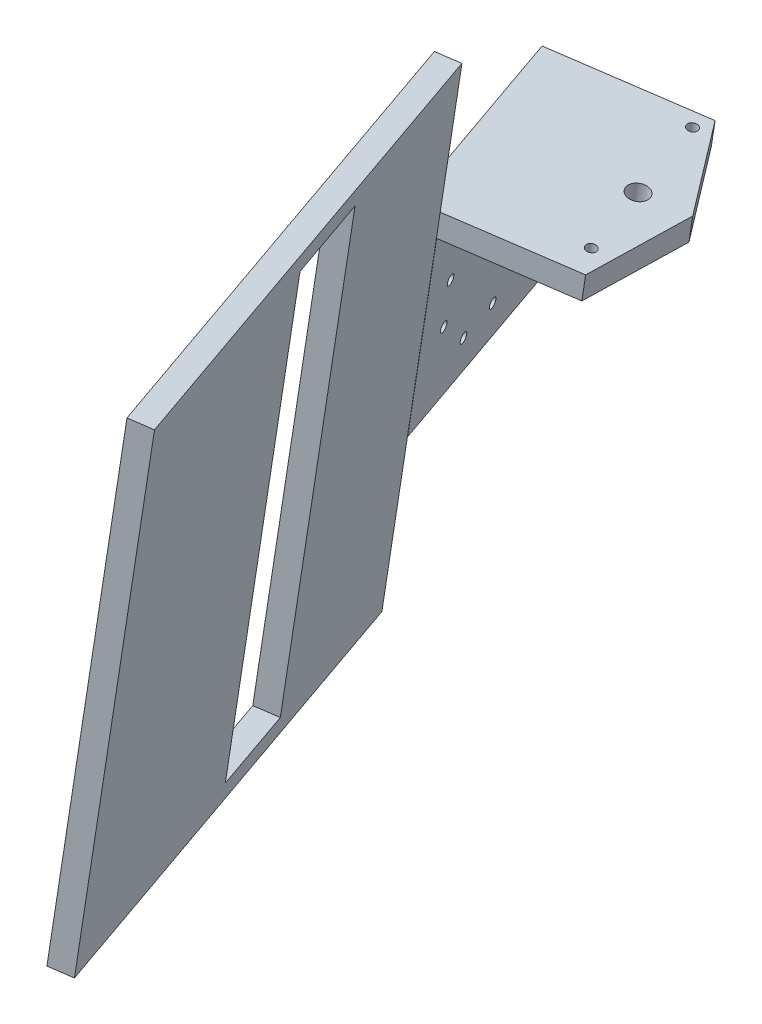
ISO-10303-21;
HEADER;
FILE_DESCRIPTION(('STEP AP214'),'2;1');
FILE_NAME('part.step','',(''),(''),'','','');
FILE_SCHEMA(('AUTOMOTIVE_DESIGN { 1 0 10303 214 1 1 1 1 }'));
ENDSEC;
DATA;
#1=APPLICATION_CONTEXT('core data for automotive mechanical design processes');
#2=APPLICATION_PROTOCOL_DEFINITION('international standard','automotive_design',2000,#1);
#3=PRODUCT_CONTEXT('',#1,'mechanical');
#4=PRODUCT('Part','Part','',(#3));
#5=PRODUCT_RELATED_PRODUCT_CATEGORY('part','',(#4));
#6=PRODUCT_DEFINITION_FORMATION('','',#4);
#7=PRODUCT_DEFINITION_CONTEXT('part definition',#1,'design');
#8=PRODUCT_DEFINITION('design','',#6,#7);
#9=PRODUCT_DEFINITION_SHAPE('','',#8);
#10=(LENGTH_UNIT() NAMED_UNIT(*) SI_UNIT(.MILLI.,.METRE.));
#11=(NAMED_UNIT(*) PLANE_ANGLE_UNIT() SI_UNIT($,.RADIAN.));
#12=(NAMED_UNIT(*) SI_UNIT($,.STERADIAN.) SOLID_ANGLE_UNIT());
#13=UNCERTAINTY_MEASURE_WITH_UNIT(LENGTH_MEASURE(1.E-05),#10,'distance_accuracy_value','');
#14=(GEOMETRIC_REPRESENTATION_CONTEXT(3) GLOBAL_UNCERTAINTY_ASSIGNED_CONTEXT((#13)) GLOBAL_UNIT_ASSIGNED_CONTEXT((#10,
#11,#12)) REPRESENTATION_CONTEXT('',''));
#15=CARTESIAN_POINT('',(0.,0.,0.));
#16=DIRECTION('',(0.,0.,1.));
#17=DIRECTION('',(1.,0.,0.));
#18=AXIS2_PLACEMENT_3D('',#15,#16,#17);
#19=CARTESIAN_POINT('',(-17.1863898613253,-49.3493626295614,61.5794038347499));
#20=DIRECTION('',(0.300437155148662,-0.046712923054129,0.95265703095391));
#21=DIRECTION('',(0.953698130209388,0.,-0.30076548411531));
#22=AXIS2_PLACEMENT_3D('',#19,#20,#21);
#23=PLANE('',#22);
#24=DIRECTION('',(0.941346447465451,-0.146363535315639,-0.304047005204922));
#25=VECTOR('',#24,1.);
#26=CARTESIAN_POINT('',(16.7261494264922,22.7969804188848,54.422137332226));
#27=LINE('',#26,#25);
#28=CARTESIAN_POINT('',(-9.63155110254046,26.8951594077227,62.9354534779639));
#29=VERTEX_POINT('',#28);
#30=CARTESIAN_POINT('',(-5.43314594684452,26.242378040215,61.5794038347499));
#31=VERTEX_POINT('',#30);
#32=EDGE_CURVE('E175',#29,#31,#27,.T.);
#33=ORIENTED_EDGE('',*,*,#32,.F.);
#34=DIRECTION('',(-0.15363717535269,-0.988127329016684,0.));
#35=VECTOR('',#34,1.);
#36=CARTESIAN_POINT('',(-21.3847950170213,-48.6965812620537,62.9354534779639));
#37=LINE('',#36,#35);
#38=CARTESIAN_POINT('',(-5.25289160498879,55.0567882846982,62.9354534779639));
#39=VERTEX_POINT('',#38);
#40=EDGE_CURVE('E189',#39,#29,#37,.T.);
#41=ORIENTED_EDGE('',*,*,#40,.F.);
#42=DIRECTION('',(-0.941346447465451,0.146363535315639,0.304047005204922));
#43=VECTOR('',#42,1.);
#44=CARTESIAN_POINT('',(-1.05448644929285,54.4040069171904,61.5794038347499));
#45=LINE('',#44,#43);
#46=CARTESIAN_POINT('',(-1.05448644929285,54.4040069171904,61.5794038347499));
#47=VERTEX_POINT('',#46);
#48=EDGE_CURVE('E265',#47,#39,#45,.T.);
#49=ORIENTED_EDGE('',*,*,#48,.F.);
#50=DIRECTION('',(0.15363717535269,0.988127329016684,0.));
#51=VECTOR('',#50,1.);
#52=CARTESIAN_POINT('',(-17.1863898613253,-49.3493626295614,61.5794038347499));
#53=LINE('',#52,#51);
#54=EDGE_CURVE('E191',#31,#47,#53,.T.);
#55=ORIENTED_EDGE('',*,*,#54,.F.);
#56=EDGE_LOOP('',(#33,#41,#49,#55));
#57=FACE_BOUND('',#56,.T.);
#58=ADVANCED_FACE('F41',(#57),#23,.F.);
#59=DIRECTION('',(-0.941346447465451,0.146363535315639,0.304047005204922));
#60=VECTOR('',#59,1.);
#61=CARTESIAN_POINT('',(-15.2966031952407,-15.7406792753104,62.6314064727589));
#62=LINE('',#61,#60);
#63=CARTESIAN_POINT('',(-12.0395444870102,-16.2470971075025,61.5794038347499));
#64=VERTEX_POINT('',#63);
#65=CARTESIAN_POINT('',(-16.2379496427062,-15.5943157399947,62.9354534779639));
#66=VERTEX_POINT('',#65);
#67=EDGE_CURVE('E260',#64,#66,#62,.T.);
#68=ORIENTED_EDGE('',*,*,#67,.F.);
#69=CARTESIAN_POINT('',(-17.1863898613253,-49.3493626295614,61.5794038347499));
#70=VERTEX_POINT('',#69);
#71=EDGE_CURVE('E249',#70,#64,#53,.T.);
#72=ORIENTED_EDGE('',*,*,#71,.F.);
#73=DIRECTION('',(-0.941346447465451,0.146363535315639,0.304047005204922));
#74=VECTOR('',#73,1.);
#75=CARTESIAN_POINT('',(-17.1863898613253,-49.3493626295614,61.5794038347499));
#76=LINE('',#75,#74);
#77=CARTESIAN_POINT('',(-21.3847950170213,-48.6965812620537,62.9354534779639));
#78=VERTEX_POINT('',#77);
#79=EDGE_CURVE('E261',#70,#78,#76,.T.);
#80=ORIENTED_EDGE('',*,*,#79,.T.);
#81=DIRECTION('',(-0.15363717535269,-0.988127329016684,0.));
#82=VECTOR('',#81,1.);
#83=CARTESIAN_POINT('',(-21.3847950170213,-48.6965812620537,62.9354534779639));
#84=LINE('',#83,#82);
#85=EDGE_CURVE('E203',#66,#78,#84,.T.);
#86=ORIENTED_EDGE('',*,*,#85,.F.);
#87=EDGE_LOOP('',(#68,#72,#80,#86));
#88=FACE_BOUND('',#87,.T.);
#89=ADVANCED_FACE('F368',(#88),#23,.F.);
#90=CARTESIAN_POINT('',(-6.35576339228975,3.10947705619133,18.748232135709));
#91=DIRECTION('',(-0.300437155148661,0.0467129230541289,-0.95265703095391));
#92=DIRECTION('',(0.15363717535269,0.988127329016684,0.));
#93=AXIS2_PLACEMENT_3D('',#90,#91,#92);
#94=PLANE('',#93);
#95=DIRECTION('',(0.941346447465451,-0.146363535315639,-0.304047005204922));
#96=VECTOR('',#95,1.);
#97=CARTESIAN_POINT('',(-2.64894778847588,20.749405443176,18.4441851305041));
#98=LINE('',#97,#96);
#99=CARTESIAN_POINT('',(-18.1811641716558,23.1644037758841,23.4609607163853));
#100=VERTEX_POINT('',#99);
#101=CARTESIAN_POINT('',(3.94047734378228,19.7248606959665,16.3158560940696));
#102=VERTEX_POINT('',#101);
#103=EDGE_CURVE('E302',#100,#102,#98,.T.);
#104=ORIENTED_EDGE('',*,*,#103,.F.);
#105=DIRECTION('',(0.15363717535269,0.988127329016684,0.));
#106=VECTOR('',#105,1.);
#107=CARTESIAN_POINT('',(-18.1811641716558,23.1644037758841,23.4609607163853));
#108=LINE('',#107,#106);
#109=CARTESIAN_POINT('',(-24.019376835058,-14.3844347267499,23.4609607163853));
#110=VERTEX_POINT('',#109);
#111=EDGE_CURVE('E423',#110,#100,#108,.T.);
#112=ORIENTED_EDGE('',*,*,#111,.F.);
#113=DIRECTION('',(0.941346447465451,-0.146363535315639,-0.304047005204922));
#114=VECTOR('',#113,1.);
#115=CARTESIAN_POINT('',(-27.3140894011871,-13.8721623531452,24.5251252346025));
#116=LINE('',#115,#114);
#117=CARTESIAN_POINT('',(-28.2554358486526,-13.7257988178296,24.8291722398075));
#118=VERTEX_POINT('',#117);
#119=EDGE_CURVE('E311',#118,#110,#116,.T.);
#120=ORIENTED_EDGE('',*,*,#119,.F.);
#121=DIRECTION('',(-0.15363717535269,-0.988127329016684,0.));
#122=VECTOR('',#121,1.);
#123=CARTESIAN_POINT('',(-25.1826923415988,6.03674776250411,24.8291722398075));
#124=LINE('',#123,#122);
#125=CARTESIAN_POINT('',(-21.6490373084869,28.7636763298879,24.8291722398075));
#126=VERTEX_POINT('',#125);
#127=EDGE_CURVE('E292',#126,#118,#124,.T.);
#128=ORIENTED_EDGE('',*,*,#127,.F.);
#129=DIRECTION('',(-0.941346447465451,0.146363535315639,0.304047005204922));
#130=VECTOR('',#129,1.);
#131=CARTESIAN_POINT('',(-21.6490373084869,28.7636763298879,24.8291722398075));
#132=LINE('',#131,#130);
#133=CARTESIAN_POINT('',(4.70866322054573,24.66549734105,16.3158560940696));
#134=VERTEX_POINT('',#133);
#135=EDGE_CURVE('E179',#134,#126,#132,.T.);
#136=ORIENTED_EDGE('',*,*,#135,.F.);
#137=DIRECTION('',(-0.15363717535269,-0.988127329016684,0.));
#138=VECTOR('',#137,1.);
#139=CARTESIAN_POINT('',(1.17500818743386,1.93856877366622,16.3158560940696));
#140=LINE('',#139,#138);
#141=EDGE_CURVE('E305',#134,#102,#140,.T.);
#142=ORIENTED_EDGE('',*,*,#141,.T.);
#143=EDGE_LOOP('',(#104,#112,#120,#128,#136,#142));
#144=FACE_BOUND('',#143,.T.);
#145=ADVANCED_FACE('F373',(#144),#94,.T.);
#146=CARTESIAN_POINT('',(-27.3140894011871,-13.8721623531452,24.5251252346025));
#147=DIRECTION('',(-0.15363717535269,-0.988127329016684,0.));
#148=DIRECTION('',(-0.300437155148661,0.0467129230541289,-0.95265703095391));
#149=AXIS2_PLACEMENT_3D('',#146,#147,#148);
#150=PLANE('',#149);
#151=ORIENTED_EDGE('',*,*,#67,.T.);
#152=DIRECTION('',(0.300437155148661,-0.0467129230541289,0.95265703095391));
#153=VECTOR('',#152,1.);
#154=CARTESIAN_POINT('',(-28.2554358486526,-13.7257988178296,24.8291722398075));
#155=LINE('',#154,#153);
#156=EDGE_CURVE('E315',#118,#66,#155,.T.);
#157=ORIENTED_EDGE('',*,*,#156,.F.);
#158=ORIENTED_EDGE('',*,*,#119,.T.);
#159=DIRECTION('',(-0.300437155148662,0.0467129230541289,-0.952657030953909));
#160=VECTOR('',#159,1.);
#161=CARTESIAN_POINT('',(-12.0018906291116,-16.2529516489151,61.5672419545417));
#162=LINE('',#161,#160);
#163=CARTESIAN_POINT('',(-12.0018906291116,-16.2529516489151,61.5672419545417));
#164=VERTEX_POINT('',#163);
#165=EDGE_CURVE('E413',#164,#110,#162,.T.);
#166=ORIENTED_EDGE('',*,*,#165,.F.);
#167=DIRECTION('',(-0.941346447465451,0.146363535315639,0.304047005204922));
#168=VECTOR('',#167,1.);
#169=CARTESIAN_POINT('',(-12.0018906291116,-16.2529516489151,61.5672419545417));
#170=LINE('',#169,#168);
#171=EDGE_CURVE('E429',#164,#64,#170,.T.);
#172=ORIENTED_EDGE('',*,*,#171,.T.);
#173=EDGE_LOOP('',(#151,#157,#158,#166,#172));
#174=FACE_BOUND('',#173,.T.);
#175=ADVANCED_FACE('F386',(#174),#150,.T.);
#176=CARTESIAN_POINT('',(11.3551398777975,-53.7870903197037,152.081821775371));
#177=DIRECTION('',(0.300437155148662,-0.046712923054129,0.95265703095391));
#178=DIRECTION('',(0.953698130209388,0.,-0.30076548411531));
#179=AXIS2_PLACEMENT_3D('',#176,#177,#178);
#180=PLANE('',#179);
#181=DIRECTION('',(-0.941346447465451,0.146363535315639,0.304047005204922));
#182=VECTOR('',#181,1.);
#183=CARTESIAN_POINT('',(27.48704328983,49.9662792270482,152.081821775371));
#184=LINE('',#183,#182);
#185=CARTESIAN_POINT('',(27.48704328983,49.9662792270482,152.081821775371));
#186=VERTEX_POINT('',#185);
#187=CARTESIAN_POINT('',(23.288638134134,50.6190605945559,153.437871418585));
#188=VERTEX_POINT('',#187);
#189=EDGE_CURVE('E255',#186,#188,#184,.T.);
#190=ORIENTED_EDGE('',*,*,#189,.T.);
#191=DIRECTION('',(-0.15363717535269,-0.988127329016684,0.));
#192=VECTOR('',#191,1.);
#193=CARTESIAN_POINT('',(7.15673472210156,-53.1343089521959,153.437871418585));
#194=LINE('',#193,#192);
#195=CARTESIAN_POINT('',(7.15673472210156,-53.1343089521959,153.437871418585));
#196=VERTEX_POINT('',#195);
#197=EDGE_CURVE('E65',#188,#196,#194,.T.);
#198=ORIENTED_EDGE('',*,*,#197,.T.);
#199=DIRECTION('',(-0.941346447465451,0.146363535315639,0.304047005204922));
#200=VECTOR('',#199,1.);
#201=CARTESIAN_POINT('',(11.3551398777975,-53.7870903197037,152.081821775371));
#202=LINE('',#201,#200);
#203=CARTESIAN_POINT('',(11.3551398777975,-53.7870903197037,152.081821775371));
#204=VERTEX_POINT('',#203);
#205=EDGE_CURVE('E256',#204,#196,#202,.T.);
#206=ORIENTED_EDGE('',*,*,#205,.F.);
#207=DIRECTION('',(0.15363717535269,0.988127329016684,0.));
#208=VECTOR('',#207,1.);
#209=CARTESIAN_POINT('',(11.3551398777975,-53.7870903197037,152.081821775371));
#210=LINE('',#209,#208);
#211=EDGE_CURVE('E241',#204,#186,#210,.T.);
#212=ORIENTED_EDGE('',*,*,#211,.T.);
#213=EDGE_LOOP('',(#190,#198,#206,#212));
#214=FACE_BOUND('',#213,.T.);
#215=ADVANCED_FACE('F383',(#214),#180,.T.);
#216=CARTESIAN_POINT('',(11.3551398777975,-53.7870903197037,152.081821775371));
#217=DIRECTION('',(0.15363717535269,0.988127329016684,0.));
#218=DIRECTION('',(-0.988127329016684,0.15363717535269,0.));
#219=AXIS2_PLACEMENT_3D('',#216,#217,#218);
#220=PLANE('',#219);
#221=DIRECTION('',(0.300437155148661,-0.0467129230541289,0.95265703095391));
#222=VECTOR('',#221,1.);
#223=CARTESIAN_POINT('',(7.15673472210156,-53.1343089521959,153.437871418585));
#224=LINE('',#223,#222);
#225=EDGE_CURVE('E199',#78,#196,#224,.T.);
#226=ORIENTED_EDGE('',*,*,#225,.F.);
#227=ORIENTED_EDGE('',*,*,#79,.F.);
#228=DIRECTION('',(-0.300437155148662,0.046712923054129,-0.952657030953909));
#229=VECTOR('',#228,1.);
#230=CARTESIAN_POINT('',(11.3551398777975,-53.7870903197037,152.081821775371));
#231=LINE('',#230,#229);
#232=EDGE_CURVE('E252',#204,#70,#231,.T.);
#233=ORIENTED_EDGE('',*,*,#232,.F.);
#234=ORIENTED_EDGE('',*,*,#205,.T.);
#235=EDGE_LOOP('',(#226,#227,#233,#234));
#236=FACE_BOUND('',#235,.T.);
#237=ADVANCED_FACE('F377',(#236),#220,.F.);
#238=CARTESIAN_POINT('',(27.48704328983,49.9662792270482,152.081821775371));
#239=DIRECTION('',(0.15363717535269,0.988127329016684,0.));
#240=DIRECTION('',(-0.988127329016684,0.15363717535269,0.));
#241=AXIS2_PLACEMENT_3D('',#238,#239,#240);
#242=PLANE('',#241);
#243=ORIENTED_EDGE('',*,*,#48,.T.);
#244=DIRECTION('',(0.300437155148661,-0.0467129230541289,0.95265703095391));
#245=VECTOR('',#244,1.);
#246=CARTESIAN_POINT('',(23.288638134134,50.6190605945559,153.437871418585));
#247=LINE('',#246,#245);
#248=EDGE_CURVE('E197',#39,#188,#247,.T.);
#249=ORIENTED_EDGE('',*,*,#248,.T.);
#250=ORIENTED_EDGE('',*,*,#189,.F.);
#251=DIRECTION('',(-0.300437155148662,0.046712923054129,-0.952657030953909));
#252=VECTOR('',#251,1.);
#253=CARTESIAN_POINT('',(27.48704328983,49.9662792270482,152.081821775371));
#254=LINE('',#253,#252);
#255=EDGE_CURVE('E245',#186,#47,#254,.T.);
#256=ORIENTED_EDGE('',*,*,#255,.T.);
#257=EDGE_LOOP('',(#243,#249,#250,#256));
#258=FACE_BOUND('',#257,.T.);
#259=ADVANCED_FACE('F378',(#258),#242,.T.);
#260=CARTESIAN_POINT('',(29.5364840447831,-4.59242634550558,100.690553554661));
#261=DIRECTION('',(0.300437155148662,-0.046712923054129,0.95265703095391));
#262=DIRECTION('',(0.953698130209388,0.,-0.30076548411531));
#263=AXIS2_PLACEMENT_3D('',#260,#261,#262);
#264=PLANE('',#263);
#265=DIRECTION('',(-0.15363717535269,-0.988127329016684,0.));
#266=VECTOR('',#265,1.);
#267=CARTESIAN_POINT('',(1.2960906208195,-0.201520286036394,109.811963710808));
#268=LINE('',#267,#266);
#269=CARTESIAN_POINT('',(8.99271049848715,49.299783188971,109.811963710808));
#270=VERTEX_POINT('',#269);
#271=CARTESIAN_POINT('',(-6.06373268607651,-47.5366950546641,109.811963710808));
#272=VERTEX_POINT('',#271);
#273=EDGE_CURVE('E441',#270,#272,#268,.T.);
#274=ORIENTED_EDGE('',*,*,#273,.F.);
#275=DIRECTION('',(-0.941346447465451,0.146363535315639,0.304047005204922));
#276=VECTOR('',#275,1.);
#277=CARTESIAN_POINT('',(37.2331039224507,44.9088771295018,100.690553554661));
#278=LINE('',#277,#276);
#279=CARTESIAN_POINT('',(13.1911156541831,48.6470018214632,108.455914067594));
#280=VERTEX_POINT('',#279);
#281=EDGE_CURVE('E210',#280,#270,#278,.T.);
#282=ORIENTED_EDGE('',*,*,#281,.F.);
#283=DIRECTION('',(0.15363717535269,0.988127329016684,0.));
#284=VECTOR('',#283,1.);
#285=CARTESIAN_POINT('',(5.49449577651546,-0.854301653544155,108.455914067594));
#286=LINE('',#285,#284);
#287=CARTESIAN_POINT('',(-1.86532753038054,-48.1894764221718,108.455914067594));
#288=VERTEX_POINT('',#287);
#289=EDGE_CURVE('E237',#288,#280,#286,.T.);
#290=ORIENTED_EDGE('',*,*,#289,.F.);
#291=DIRECTION('',(-0.941346447465451,0.146363535315639,0.304047005204922));
#292=VECTOR('',#291,1.);
#293=CARTESIAN_POINT('',(22.1766607378871,-51.9276011141332,100.690553554661));
#294=LINE('',#293,#292);
#295=EDGE_CURVE('E222',#288,#272,#294,.T.);
#296=ORIENTED_EDGE('',*,*,#295,.T.);
#297=EDGE_LOOP('',(#274,#282,#290,#296));
#298=FACE_BOUND('',#297,.T.);
#299=ADVANCED_FACE('F381',(#298),#264,.F.);
#300=CARTESIAN_POINT('',(-9.37282978303244,-47.0221861285219,0.650184203887233));
#301=DIRECTION('',(0.15363717535269,0.988127329016684,0.));
#302=DIRECTION('',(-0.988127329016684,0.15363717535269,0.));
#303=AXIS2_PLACEMENT_3D('',#300,#301,#302);
#304=PLANE('',#303);
#305=DIRECTION('',(-0.941346447465451,0.146363535315639,0.304047005204922));
#306=VECTOR('',#305,1.);
#307=CARTESIAN_POINT('',(17.0692291003598,-51.1334814222131,84.4953840284441));
#308=LINE('',#307,#306);
#309=CARTESIAN_POINT('',(-6.97275916790779,-47.3953567302516,92.2607445413778));
#310=VERTEX_POINT('',#309);
#311=CARTESIAN_POINT('',(-11.1711643236038,-46.7425753627439,93.6167941845918));
#312=VERTEX_POINT('',#311);
#313=EDGE_CURVE('E218',#310,#312,#308,.T.);
#314=ORIENTED_EDGE('',*,*,#313,.T.);
#315=DIRECTION('',(0.300437155148661,-0.0467129230541288,0.95265703095391));
#316=VECTOR('',#315,1.);
#317=CARTESIAN_POINT('',(-37.613223206996,-42.6312800690527,9.7715943600349));
#318=LINE('',#317,#316);
#319=EDGE_CURVE('E437',#312,#272,#318,.T.);
#320=ORIENTED_EDGE('',*,*,#319,.T.);
#321=ORIENTED_EDGE('',*,*,#295,.F.);
#322=DIRECTION('',(-0.300437155148662,0.0467129230541289,-0.95265703095391));
#323=VECTOR('',#322,1.);
#324=CARTESIAN_POINT('',(-33.4148180513001,-43.2840614365605,8.41554471682096));
#325=LINE('',#324,#323);
#326=EDGE_CURVE('E234',#288,#310,#325,.T.);
#327=ORIENTED_EDGE('',*,*,#326,.T.);
#328=EDGE_LOOP('',(#314,#320,#321,#327));
#329=FACE_BOUND('',#328,.T.);
#330=ADVANCED_FACE('F742',(#329),#304,.T.);
#331=CARTESIAN_POINT('',(24.4290524072558,-3.79830665358538,84.4953840284441));
#332=DIRECTION('',(0.300437155148662,-0.046712923054129,0.95265703095391));
#333=DIRECTION('',(0.953698130209388,0.,-0.30076548411531));
#334=AXIS2_PLACEMENT_3D('',#331,#332,#333);
#335=PLANE('',#334);
#336=DIRECTION('',(-0.941346447465451,0.146363535315639,0.304047005204922));
#337=VECTOR('',#336,1.);
#338=CARTESIAN_POINT('',(32.1256722849235,45.702996821422,84.4953840284441));
#339=LINE('',#338,#337);
#340=CARTESIAN_POINT('',(8.08368401665586,49.4411215133834,92.2607445413778));
#341=VERTEX_POINT('',#340);
#342=CARTESIAN_POINT('',(3.88527886095991,50.0939028808912,93.6167941845918));
#343=VERTEX_POINT('',#342);
#344=EDGE_CURVE('E214',#341,#343,#339,.T.);
#345=ORIENTED_EDGE('',*,*,#344,.T.);
#346=DIRECTION('',(-0.15363717535269,-0.988127329016684,0.));
#347=VECTOR('',#346,1.);
#348=CARTESIAN_POINT('',(-3.81134101670775,0.592599405883799,93.6167941845918));
#349=LINE('',#348,#347);
#350=EDGE_CURVE('E433',#343,#312,#349,.T.);
#351=ORIENTED_EDGE('',*,*,#350,.T.);
#352=ORIENTED_EDGE('',*,*,#313,.F.);
#353=DIRECTION('',(0.15363717535269,0.988127329016684,0.));
#354=VECTOR('',#353,1.);
#355=CARTESIAN_POINT('',(0.387064138988209,-0.0601819616239622,92.2607445413778));
#356=LINE('',#355,#354);
#357=EDGE_CURVE('E230',#310,#341,#356,.T.);
#358=ORIENTED_EDGE('',*,*,#357,.T.);
#359=EDGE_LOOP('',(#345,#351,#352,#358));
#360=FACE_BOUND('',#359,.T.);
#361=ADVANCED_FACE('F738',(#360),#335,.T.);
#362=CARTESIAN_POINT('',(5.6836134015312,49.8142921151131,0.650184203887226));
#363=DIRECTION('',(0.15363717535269,0.988127329016684,0.));
#364=DIRECTION('',(-0.988127329016684,0.15363717535269,0.));
#365=AXIS2_PLACEMENT_3D('',#362,#363,#364);
#366=PLANE('',#365);
#367=DIRECTION('',(0.300437155148661,-0.0467129230541288,0.95265703095391));
#368=VECTOR('',#367,1.);
#369=CARTESIAN_POINT('',(-22.5567800224324,54.2051981745823,9.77159436003489));
#370=LINE('',#369,#368);
#371=EDGE_CURVE('E11',#343,#270,#370,.T.);
#372=ORIENTED_EDGE('',*,*,#371,.F.);
#373=ORIENTED_EDGE('',*,*,#344,.F.);
#374=DIRECTION('',(-0.300437155148662,0.0467129230541289,-0.95265703095391));
#375=VECTOR('',#374,1.);
#376=CARTESIAN_POINT('',(-18.3583748667364,53.5524168070745,8.41554471682094));
#377=LINE('',#376,#375);
#378=EDGE_CURVE('E226',#280,#341,#377,.T.);
#379=ORIENTED_EDGE('',*,*,#378,.F.);
#380=ORIENTED_EDGE('',*,*,#281,.T.);
#381=EDGE_LOOP('',(#372,#373,#379,#380));
#382=FACE_BOUND('',#381,.T.);
#383=ADVANCED_FACE('F556',(#382),#366,.F.);
#384=CARTESIAN_POINT('',(5.66172281365671,1.24096013402617,56.8545133738654));
#385=DIRECTION('',(-0.300437155148661,0.0467129230541289,-0.95265703095391));
#386=DIRECTION('',(0.15363717535269,0.988127329016684,0.));
#387=AXIS2_PLACEMENT_3D('',#384,#385,#386);
#388=PLANE('',#387);
#389=EDGE_CURVE('E57',#64,#31,#53,.T.);
#390=ORIENTED_EDGE('',*,*,#389,.F.);
#391=ORIENTED_EDGE('',*,*,#171,.F.);
#392=DIRECTION('',(-0.15363717535269,-0.988127329016684,0.));
#393=VECTOR('',#392,1.);
#394=CARTESIAN_POINT('',(-6.16367796570935,21.2958868537189,61.5672419545417));
#395=LINE('',#394,#393);
#396=CARTESIAN_POINT('',(-6.16367796570935,21.2958868537189,61.5672419545417));
#397=VERTEX_POINT('',#396);
#398=EDGE_CURVE('E407',#397,#164,#395,.T.);
#399=ORIENTED_EDGE('',*,*,#398,.F.);
#400=DIRECTION('',(0.941346447465451,-0.146363535315639,-0.304047005204922));
#401=VECTOR('',#400,1.);
#402=CARTESIAN_POINT('',(9.36853841747058,18.8808885210109,56.5504663686605));
#403=LINE('',#402,#401);
#404=CARTESIAN_POINT('',(15.9579635497287,17.8563437738014,54.422137332226));
#405=VERTEX_POINT('',#404);
#406=EDGE_CURVE('E287',#397,#405,#403,.T.);
#407=ORIENTED_EDGE('',*,*,#406,.T.);
#408=DIRECTION('',(0.15363717535269,0.988127329016684,0.));
#409=VECTOR('',#408,1.);
#410=CARTESIAN_POINT('',(16.2652379004341,19.8325984318348,54.422137332226));
#411=LINE('',#410,#409);
#412=CARTESIAN_POINT('',(16.7261494264922,22.7969804188848,54.422137332226));
#413=VERTEX_POINT('',#412);
#414=EDGE_CURVE('E329',#405,#413,#411,.T.);
#415=ORIENTED_EDGE('',*,*,#414,.T.);
#416=EDGE_CURVE('E182',#31,#413,#27,.T.);
#417=ORIENTED_EDGE('',*,*,#416,.F.);
#418=EDGE_LOOP('',(#390,#391,#399,#407,#415,#417));
#419=FACE_BOUND('',#418,.T.);
#420=ADVANCED_FACE('F551',(#419),#388,.F.);
#421=CARTESIAN_POINT('',(13.1924943933803,0.0700518515010656,54.422137332226));
#422=DIRECTION('',(0.987901933056074,-0.15360213007289,0.0213578159263423));
#423=DIRECTION('',(-0.15363717535269,-0.988127329016684,0.));
#424=AXIS2_PLACEMENT_3D('',#421,#422,#423);
#425=PLANE('',#424);
#426=DIRECTION('',(-0.0211042416049268,0.00328135451062598,0.999771895833673));
#427=VECTOR('',#426,1.);
#428=CARTESIAN_POINT('',(16.7085900889742,17.7396339755316,18.8626828750067));
#429=LINE('',#428,#427);
#430=CARTESIAN_POINT('',(16.4041675150901,17.7869665641481,33.2841029631712));
#431=VERTEX_POINT('',#430);
#432=EDGE_CURVE('E283',#431,#405,#429,.T.);
#433=ORIENTED_EDGE('',*,*,#432,.F.);
#434=DIRECTION('',(0.15363717535269,0.988127329016684,0.));
#435=VECTOR('',#434,1.);
#436=CARTESIAN_POINT('',(13.6386983587417,0.000674641847824009,33.2841029631712));
#437=LINE('',#436,#435);
#438=CARTESIAN_POINT('',(17.1723533918535,22.7276032092316,33.2841029631712));
#439=VERTEX_POINT('',#438);
#440=EDGE_CURVE('E50',#431,#439,#437,.T.);
#441=ORIENTED_EDGE('',*,*,#440,.T.);
#442=DIRECTION('',(0.0211042416049283,-0.00328135451062629,-0.999771895833673));
#443=VECTOR('',#442,1.);
#444=CARTESIAN_POINT('',(17.1723533918535,22.7276032092316,33.2841029631712));
#445=LINE('',#444,#443);
#446=EDGE_CURVE('E193',#413,#439,#445,.T.);
#447=ORIENTED_EDGE('',*,*,#446,.F.);
#448=ORIENTED_EDGE('',*,*,#414,.F.);
#449=EDGE_LOOP('',(#433,#441,#447,#448));
#450=FACE_BOUND('',#449,.T.);
#451=ADVANCED_FACE('F391',(#450),#425,.T.);
#452=CARTESIAN_POINT('',(25.9055723189235,17.321673294301,46.0102881149974));
#453=DIRECTION('',(-0.79302377836505,0.123301855659401,0.596581879827546));
#454=DIRECTION('',(0.589498859453746,-0.0916571548833023,0.802552216781831));
#455=AXIS2_PLACEMENT_3D('',#452,#453,#454);
#456=PLANE('',#455);
#457=ORIENTED_EDGE('',*,*,#440,.F.);
#458=DIRECTION('',(0.589498859453746,-0.0916571548833023,0.802552216781831));
#459=VECTOR('',#458,1.);
#460=CARTESIAN_POINT('',(2.60215560880621,19.9329472097557,14.4938456559703));
#461=LINE('',#460,#459);
#462=EDGE_CURVE('E278',#102,#431,#461,.T.);
#463=ORIENTED_EDGE('',*,*,#462,.F.);
#464=ORIENTED_EDGE('',*,*,#141,.F.);
#465=DIRECTION('',(-0.589498859453747,0.0916571548833024,-0.80255221678183));
#466=VECTOR('',#465,1.);
#467=CARTESIAN_POINT('',(4.70866322054573,24.66549734105,16.3158560940696));
#468=LINE('',#467,#466);
#469=EDGE_CURVE('E824',#439,#134,#468,.T.);
#470=ORIENTED_EDGE('',*,*,#469,.F.);
#471=EDGE_LOOP('',(#457,#463,#464,#470));
#472=FACE_BOUND('',#471,.T.);
#473=ADVANCED_FACE('F388',(#472),#456,.F.);
#474=CARTESIAN_POINT('',(8.87418941061089,-4.31860100000067,49.7429848208417));
#475=DIRECTION('',(0.15363717535269,0.988127329016684,0.));
#476=DIRECTION('',(0.941346447465451,-0.146363535315639,-0.304047005204922));
#477=AXIS2_PLACEMENT_3D('',#474,#475,#476);
#478=CYLINDRICAL_SURFACE('',#477,1.);
#479=CARTESIAN_POINT('',(12.4078444437228,18.4083275673831,49.7429848208417));
#480=DIRECTION('',(-0.15363717535269,-0.988127329016684,0.));
#481=DIRECTION('',(-0.300437155148661,0.0467129230541289,-0.95265703095391));
#482=AXIS2_PLACEMENT_3D('',#479,#480,#481);
#483=CIRCLE('',#482,1.);
#484=CARTESIAN_POINT('',(12.1074072885741,18.4550404904372,48.7903277898878));
#485=VERTEX_POINT('',#484);
#486=EDGE_CURVE('E288',#485,#485,#483,.T.);
#487=ORIENTED_EDGE('',*,*,#486,.T.);
#488=EDGE_LOOP('',(#487));
#489=FACE_BOUND('',#488,.T.);
#490=CARTESIAN_POINT('',(13.1760303204862,23.3489642124665,49.7429848208417));
#491=DIRECTION('',(0.15363717535269,0.988127329016684,0.));
#492=DIRECTION('',(-0.988127329016684,0.15363717535269,0.));
#493=AXIS2_PLACEMENT_3D('',#490,#491,#492);
#494=CIRCLE('',#493,1.);
#495=CARTESIAN_POINT('',(12.1879029914695,23.5026013878192,49.7429848208417));
#496=VERTEX_POINT('',#495);
#497=EDGE_CURVE('E876',#496,#496,#494,.T.);
#498=ORIENTED_EDGE('',*,*,#497,.T.);
#499=EDGE_LOOP('',(#498));
#500=FACE_BOUND('',#499,.T.);
#501=ADVANCED_FACE('F390',(#489,#500),#478,.F.);
#502=CARTESIAN_POINT('',(-0.529493545542209,-2.85648650840643,19.9248197519843));
#503=DIRECTION('',(0.15363717535269,0.988127329016684,0.));
#504=DIRECTION('',(0.941346447465451,-0.146363535315639,-0.304047005204922));
#505=AXIS2_PLACEMENT_3D('',#502,#503,#504);
#506=CYLINDRICAL_SURFACE('',#505,1.);
#507=CARTESIAN_POINT('',(3.00416148756966,19.8704420589773,19.9248197519843));
#508=DIRECTION('',(-0.15363717535269,-0.988127329016684,0.));
#509=DIRECTION('',(-0.300437155148661,0.0467129230541289,-0.95265703095391));
#510=AXIS2_PLACEMENT_3D('',#507,#508,#509);
#511=CIRCLE('',#510,1.);
#512=CARTESIAN_POINT('',(2.703724332421,19.9171549820314,18.9721627210304));
#513=VERTEX_POINT('',#512);
#514=EDGE_CURVE('E279',#513,#513,#511,.T.);
#515=ORIENTED_EDGE('',*,*,#514,.T.);
#516=EDGE_LOOP('',(#515));
#517=FACE_BOUND('',#516,.T.);
#518=CARTESIAN_POINT('',(3.77234736433311,24.8110787040607,19.9248197519843));
#519=DIRECTION('',(0.15363717535269,0.988127329016684,0.));
#520=DIRECTION('',(-0.988127329016684,0.15363717535269,0.));
#521=AXIS2_PLACEMENT_3D('',#518,#519,#520);
#522=CIRCLE('',#521,1.);
#523=CARTESIAN_POINT('',(2.78422003531643,24.9647158794134,19.9248197519843));
#524=VERTEX_POINT('',#523);
#525=EDGE_CURVE('E183',#524,#524,#522,.T.);
#526=ORIENTED_EDGE('',*,*,#525,.T.);
#527=EDGE_LOOP('',(#526));
#528=FACE_BOUND('',#527,.T.);
#529=ADVANCED_FACE('F698',(#517,#528),#506,.F.);
#530=CARTESIAN_POINT('',(4.53287251871274,-3.6435992618685,35.9770907235577));
#531=DIRECTION('',(0.15363717535269,0.988127329016684,0.));
#532=DIRECTION('',(0.941346447465451,-0.146363535315639,-0.304047005204922));
#533=AXIS2_PLACEMENT_3D('',#530,#531,#532);
#534=CYLINDRICAL_SURFACE('',#533,2.);
#535=CARTESIAN_POINT('',(8.06652755182461,19.0833293055152,35.9770907235577));
#536=DIRECTION('',(-0.15363717535269,-0.988127329016684,0.));
#537=DIRECTION('',(-0.300437155148661,0.0467129230541289,-0.95265703095391));
#538=AXIS2_PLACEMENT_3D('',#535,#536,#537);
#539=CIRCLE('',#538,2.);
#540=CARTESIAN_POINT('',(7.46565324152728,19.1767551516235,34.0717766616499));
#541=VERTEX_POINT('',#540);
#542=EDGE_CURVE('E275',#541,#541,#539,.T.);
#543=ORIENTED_EDGE('',*,*,#542,.T.);
#544=EDGE_LOOP('',(#543));
#545=FACE_BOUND('',#544,.T.);
#546=CARTESIAN_POINT('',(8.83471342858806,24.0239659505987,35.9770907235577));
#547=DIRECTION('',(0.15363717535269,0.988127329016684,0.));
#548=DIRECTION('',(-0.988127329016684,0.15363717535269,0.));
#549=AXIS2_PLACEMENT_3D('',#546,#547,#548);
#550=CIRCLE('',#549,2.);
#551=CARTESIAN_POINT('',(6.85845877055469,24.3312403013041,35.9770907235577));
#552=VERTEX_POINT('',#551);
#553=EDGE_CURVE('E872',#552,#552,#550,.T.);
#554=ORIENTED_EDGE('',*,*,#553,.T.);
#555=EDGE_LOOP('',(#554));
#556=FACE_BOUND('',#555,.T.);
#557=ADVANCED_FACE('F581',(#545,#556),#534,.F.);
#558=CARTESIAN_POINT('',(1.29561479773957,6.47388543728225,24.3729248418387));
#559=DIRECTION('',(-0.941346447465451,0.146363535315639,0.304047005204922));
#560=DIRECTION('',(0.15363717535269,0.988127329016684,0.));
#561=AXIS2_PLACEMENT_3D('',#558,#559,#560);
#562=CYLINDRICAL_SURFACE('',#561,1.);
#563=CARTESIAN_POINT('',(-22.2380463888967,10.1329738201732,31.9740999719618));
#564=DIRECTION('',(-0.941346447465451,0.146363535315639,0.304047005204922));
#565=DIRECTION('',(0.15363717535269,0.988127329016684,0.));
#566=AXIS2_PLACEMENT_3D('',#563,#564,#565);
#567=CIRCLE('',#566,1.);
#568=CARTESIAN_POINT('',(-22.084409213544,11.1211011491899,31.9740999719618));
#569=VERTEX_POINT('',#568);
#570=EDGE_CURVE('E274',#569,#569,#567,.T.);
#571=ORIENTED_EDGE('',*,*,#570,.T.);
#572=EDGE_LOOP('',(#571));
#573=FACE_BOUND('',#572,.T.);
#574=CARTESIAN_POINT('',(-18.0019873753022,9.47433791125285,30.6058884485396));
#575=DIRECTION('',(0.941346447465451,-0.146363535315639,-0.304047005204922));
#576=DIRECTION('',(-0.307356972182089,0.,-0.951594289417007));
#577=AXIS2_PLACEMENT_3D('',#574,#575,#576);
#578=CIRCLE('',#577,1.);
#579=CARTESIAN_POINT('',(-18.3093443474843,9.47433791125285,29.6542941591226));
#580=VERTEX_POINT('',#579);
#581=EDGE_CURVE('E829',#580,#580,#578,.T.);
#582=ORIENTED_EDGE('',*,*,#581,.T.);
#583=EDGE_LOOP('',(#582));
#584=FACE_BOUND('',#583,.T.);
#585=ADVANCED_FACE('F43',(#573,#584),#562,.F.);
#586=CARTESIAN_POINT('',(-0.0871197804346371,-2.41926052386791,24.3729248418387));
#587=DIRECTION('',(-0.941346447465451,0.146363535315639,0.304047005204922));
#588=DIRECTION('',(0.15363717535269,0.988127329016684,0.));
#589=AXIS2_PLACEMENT_3D('',#586,#587,#588);
#590=CYLINDRICAL_SURFACE('',#589,1.);
#591=CARTESIAN_POINT('',(-23.6207809670709,1.23982785902307,31.9740999719618));
#592=DIRECTION('',(-0.941346447465451,0.146363535315639,0.304047005204922));
#593=DIRECTION('',(0.15363717535269,0.988127329016684,0.));
#594=AXIS2_PLACEMENT_3D('',#591,#592,#593);
#595=CIRCLE('',#594,1.);
#596=CARTESIAN_POINT('',(-23.4671437917182,2.22795518803975,31.9740999719618));
#597=VERTEX_POINT('',#596);
#598=EDGE_CURVE('E296',#597,#597,#595,.T.);
#599=ORIENTED_EDGE('',*,*,#598,.T.);
#600=EDGE_LOOP('',(#599));
#601=FACE_BOUND('',#600,.T.);
#602=CARTESIAN_POINT('',(-19.3847219534764,0.581191950102692,30.6058884485396));
#603=DIRECTION('',(0.941346447465451,-0.146363535315639,-0.304047005204922));
#604=DIRECTION('',(-0.307356972182089,0.,-0.951594289417007));
#605=AXIS2_PLACEMENT_3D('',#602,#603,#604);
#606=CIRCLE('',#605,1.);
#607=CARTESIAN_POINT('',(-19.6920789256585,0.581191950102692,29.6542941591226));
#608=VERTEX_POINT('',#607);
#609=EDGE_CURVE('E833',#608,#608,#606,.T.);
#610=ORIENTED_EDGE('',*,*,#609,.T.);
#611=EDGE_LOOP('',(#610));
#612=FACE_BOUND('',#611,.T.);
#613=ADVANCED_FACE('F580',(#601,#612),#590,.F.);
#614=CARTESIAN_POINT('',(7.63214383808834,13.5847843774955,40.5680943680552));
#615=DIRECTION('',(-0.941346447465451,0.146363535315639,0.304047005204922));
#616=DIRECTION('',(0.15363717535269,0.988127329016684,0.));
#617=AXIS2_PLACEMENT_3D('',#614,#615,#616);
#618=CYLINDRICAL_SURFACE('',#617,1.);
#619=CARTESIAN_POINT('',(-15.901517348548,17.2438727603865,48.1692694981782));
#620=DIRECTION('',(-0.941346447465451,0.146363535315639,0.304047005204922));
#621=DIRECTION('',(0.15363717535269,0.988127329016684,0.));
#622=AXIS2_PLACEMENT_3D('',#619,#620,#621);
#623=CIRCLE('',#622,1.);
#624=CARTESIAN_POINT('',(-15.7478801731953,18.2320000894032,48.1692694981782));
#625=VERTEX_POINT('',#624);
#626=EDGE_CURVE('E295',#625,#625,#623,.T.);
#627=ORIENTED_EDGE('',*,*,#626,.T.);
#628=EDGE_LOOP('',(#627));
#629=FACE_BOUND('',#628,.T.);
#630=CARTESIAN_POINT('',(-11.6654583349534,16.5852368514661,46.8010579747561));
#631=DIRECTION('',(0.941346447465451,-0.146363535315639,-0.304047005204922));
#632=DIRECTION('',(-0.307356972182089,0.,-0.951594289417007));
#633=AXIS2_PLACEMENT_3D('',#630,#631,#632);
#634=CIRCLE('',#633,0.999999999999997);
#635=CARTESIAN_POINT('',(-11.9728153071355,16.5852368514661,45.8494636853391));
#636=VERTEX_POINT('',#635);
#637=EDGE_CURVE('E837',#636,#636,#634,.T.);
#638=ORIENTED_EDGE('',*,*,#637,.T.);
#639=EDGE_LOOP('',(#638));
#640=FACE_BOUND('',#639,.T.);
#641=ADVANCED_FACE('F593',(#629,#640),#618,.F.);
#642=CARTESIAN_POINT('',(7.4238090982819,-3.58708360022113,48.1893506156865));
#643=DIRECTION('',(-0.941346447465451,0.146363535315639,0.304047005204922));
#644=DIRECTION('',(0.15363717535269,0.988127329016684,0.));
#645=AXIS2_PLACEMENT_3D('',#642,#643,#644);
#646=CYLINDRICAL_SURFACE('',#645,1.);
#647=CARTESIAN_POINT('',(-16.1098520883544,0.0720047826698461,55.7905257458095));
#648=DIRECTION('',(-0.941346447465451,0.146363535315639,0.304047005204922));
#649=DIRECTION('',(0.15363717535269,0.988127329016684,0.));
#650=AXIS2_PLACEMENT_3D('',#647,#648,#649);
#651=CIRCLE('',#650,1.);
#652=CARTESIAN_POINT('',(-15.9562149130017,1.06013211168653,55.7905257458095));
#653=VERTEX_POINT('',#652);
#654=EDGE_CURVE('E301',#653,#653,#651,.T.);
#655=ORIENTED_EDGE('',*,*,#654,.T.);
#656=EDGE_LOOP('',(#655));
#657=FACE_BOUND('',#656,.T.);
#658=CARTESIAN_POINT('',(-11.8737930747598,-0.586631126250532,54.4223142223874));
#659=DIRECTION('',(0.941346447465451,-0.146363535315639,-0.304047005204922));
#660=DIRECTION('',(-0.307356972182089,0.,-0.951594289417007));
#661=AXIS2_PLACEMENT_3D('',#658,#659,#660);
#662=CIRCLE('',#661,0.999999999999996);
#663=CARTESIAN_POINT('',(-12.1811500469419,-0.586631126250532,53.4707199329704));
#664=VERTEX_POINT('',#663);
#665=EDGE_CURVE('E841',#664,#664,#662,.T.);
#666=ORIENTED_EDGE('',*,*,#665,.T.);
#667=EDGE_LOOP('',(#666));
#668=FACE_BOUND('',#667,.T.);
#669=ADVANCED_FACE('F607',(#657,#668),#646,.F.);
#670=CARTESIAN_POINT('',(8.80654367645611,5.30606236092903,48.1893506156865));
#671=DIRECTION('',(-0.941346447465451,0.146363535315639,0.304047005204922));
#672=DIRECTION('',(0.15363717535269,0.988127329016684,0.));
#673=AXIS2_PLACEMENT_3D('',#670,#671,#672);
#674=CYLINDRICAL_SURFACE('',#673,1.);
#675=CARTESIAN_POINT('',(-14.7271175101802,8.96515074382,55.7905257458095));
#676=DIRECTION('',(-0.941346447465451,0.146363535315639,0.304047005204922));
#677=DIRECTION('',(0.15363717535269,0.988127329016684,0.));
#678=AXIS2_PLACEMENT_3D('',#675,#676,#677);
#679=CIRCLE('',#678,1.);
#680=CARTESIAN_POINT('',(-14.5734803348275,9.95327807283669,55.7905257458095));
#681=VERTEX_POINT('',#680);
#682=EDGE_CURVE('E319',#681,#681,#679,.T.);
#683=ORIENTED_EDGE('',*,*,#682,.T.);
#684=EDGE_LOOP('',(#683));
#685=FACE_BOUND('',#684,.T.);
#686=CARTESIAN_POINT('',(-10.4910584965856,8.30651483489963,54.4223142223874));
#687=DIRECTION('',(0.941346447465451,-0.146363535315639,-0.304047005204922));
#688=DIRECTION('',(-0.307356972182089,0.,-0.951594289417007));
#689=AXIS2_PLACEMENT_3D('',#686,#687,#688);
#690=CIRCLE('',#689,0.999999999999997);
#691=CARTESIAN_POINT('',(-10.7984154687677,8.30651483489963,53.4707199329704));
#692=VERTEX_POINT('',#691);
#693=EDGE_CURVE('E845',#692,#692,#690,.T.);
#694=ORIENTED_EDGE('',*,*,#693,.T.);
#695=EDGE_LOOP('',(#694));
#696=FACE_BOUND('',#695,.T.);
#697=ADVANCED_FACE('F622',(#685,#696),#674,.F.);
#698=CARTESIAN_POINT('',(4.92820944175039,14.0052006849827,31.99418108947));
#699=DIRECTION('',(-0.941346447465451,0.146363535315639,0.304047005204922));
#700=DIRECTION('',(0.15363717535269,0.988127329016684,0.));
#701=AXIS2_PLACEMENT_3D('',#698,#699,#700);
#702=CYLINDRICAL_SURFACE('',#701,1.);
#703=CARTESIAN_POINT('',(-18.6054517448859,17.6642890678737,39.5953562195931));
#704=DIRECTION('',(-0.941346447465451,0.146363535315639,0.304047005204922));
#705=DIRECTION('',(0.15363717535269,0.988127329016684,0.));
#706=AXIS2_PLACEMENT_3D('',#703,#704,#705);
#707=CIRCLE('',#706,1.);
#708=CARTESIAN_POINT('',(-18.4518145695332,18.6524163968904,39.5953562195931));
#709=VERTEX_POINT('',#708);
#710=EDGE_CURVE('E297',#709,#709,#707,.T.);
#711=ORIENTED_EDGE('',*,*,#710,.T.);
#712=EDGE_LOOP('',(#711));
#713=FACE_BOUND('',#712,.T.);
#714=CARTESIAN_POINT('',(-14.3693927312914,17.0056531589533,38.2271446961709));
#715=DIRECTION('',(0.941346447465451,-0.146363535315639,-0.304047005204922));
#716=DIRECTION('',(-0.307356972182089,0.,-0.951594289417007));
#717=AXIS2_PLACEMENT_3D('',#714,#715,#716);
#718=CIRCLE('',#717,0.999999999999997);
#719=CARTESIAN_POINT('',(-14.6767497034734,17.0056531589533,37.2755504067539));
#720=VERTEX_POINT('',#719);
#721=EDGE_CURVE('E416',#720,#720,#718,.T.);
#722=ORIENTED_EDGE('',*,*,#721,.T.);
#723=EDGE_LOOP('',(#722));
#724=FACE_BOUND('',#723,.T.);
#725=ADVANCED_FACE('F398',(#713,#724),#702,.F.);
#726=CARTESIAN_POINT('',(1.08728005793313,-10.6979825404344,31.99418108947));
#727=DIRECTION('',(-0.941346447465451,0.146363535315639,0.304047005204922));
#728=DIRECTION('',(0.15363717535269,0.988127329016684,0.));
#729=AXIS2_PLACEMENT_3D('',#726,#727,#728);
#730=CYLINDRICAL_SURFACE('',#729,1.);
#731=CARTESIAN_POINT('',(-22.4463811287032,-7.03889415754344,39.5953562195931));
#732=DIRECTION('',(-0.941346447465451,0.146363535315639,0.304047005204922));
#733=DIRECTION('',(0.15363717535269,0.988127329016684,0.));
#734=AXIS2_PLACEMENT_3D('',#731,#732,#733);
#735=CIRCLE('',#734,1.);
#736=CARTESIAN_POINT('',(-22.2927439533505,-6.05076682852676,39.5953562195931));
#737=VERTEX_POINT('',#736);
#738=EDGE_CURVE('E314',#737,#737,#735,.T.);
#739=ORIENTED_EDGE('',*,*,#738,.T.);
#740=EDGE_LOOP('',(#739));
#741=FACE_BOUND('',#740,.T.);
#742=CARTESIAN_POINT('',(-18.2103221151086,-7.69753006646381,38.2271446961709));
#743=DIRECTION('',(0.941346447465451,-0.146363535315639,-0.304047005204922));
#744=DIRECTION('',(-0.307356972182089,0.,-0.951594289417007));
#745=AXIS2_PLACEMENT_3D('',#742,#743,#744);
#746=CIRCLE('',#745,0.999999999999997);
#747=CARTESIAN_POINT('',(-18.5176790872907,-7.69753006646381,37.2755504067539));
#748=VERTEX_POINT('',#747);
#749=EDGE_CURVE('E408',#748,#748,#746,.T.);
#750=ORIENTED_EDGE('',*,*,#749,.T.);
#751=EDGE_LOOP('',(#750));
#752=FACE_BOUND('',#751,.T.);
#753=ADVANCED_FACE('F348',(#741,#752),#730,.F.);
#754=CARTESIAN_POINT('',(3.79121445427109,-11.1183988479216,40.5680943680552));
#755=DIRECTION('',(-0.941346447465451,0.146363535315639,0.304047005204922));
#756=DIRECTION('',(0.15363717535269,0.988127329016684,0.));
#757=AXIS2_PLACEMENT_3D('',#754,#755,#756);
#758=CYLINDRICAL_SURFACE('',#757,1.);
#759=CARTESIAN_POINT('',(-19.7424467323652,-7.4593104650306,48.1692694981782));
#760=DIRECTION('',(-0.941346447465451,0.146363535315639,0.304047005204922));
#761=DIRECTION('',(0.15363717535269,0.988127329016684,0.));
#762=AXIS2_PLACEMENT_3D('',#759,#760,#761);
#763=CIRCLE('',#762,1.);
#764=CARTESIAN_POINT('',(-19.5888095570125,-6.47118313601392,48.1692694981782));
#765=VERTEX_POINT('',#764);
#766=EDGE_CURVE('E291',#765,#765,#763,.T.);
#767=ORIENTED_EDGE('',*,*,#766,.T.);
#768=EDGE_LOOP('',(#767));
#769=FACE_BOUND('',#768,.T.);
#770=CARTESIAN_POINT('',(-15.5063877187707,-8.11794637395097,46.8010579747561));
#771=DIRECTION('',(0.941346447465451,-0.146363535315639,-0.304047005204922));
#772=DIRECTION('',(-0.307356972182089,0.,-0.951594289417007));
#773=AXIS2_PLACEMENT_3D('',#770,#771,#772);
#774=CIRCLE('',#773,0.999999999999989);
#775=CARTESIAN_POINT('',(-15.8137446909527,-8.11794637395097,45.8494636853391));
#776=VERTEX_POINT('',#775);
#777=EDGE_CURVE('E404',#776,#776,#774,.T.);
#778=ORIENTED_EDGE('',*,*,#777,.T.);
#779=EDGE_LOOP('',(#778));
#780=FACE_BOUND('',#779,.T.);
#781=ADVANCED_FACE('F362',(#769,#780),#758,.F.);
#782=CARTESIAN_POINT('',(-2.64894778847588,20.749405443176,18.4441851305041));
#783=DIRECTION('',(-0.15363717535269,-0.988127329016684,0.));
#784=DIRECTION('',(-0.300437155148661,0.0467129230541289,-0.95265703095391));
#785=AXIS2_PLACEMENT_3D('',#782,#783,#784);
#786=PLANE('',#785);
#787=DIRECTION('',(0.300437155148662,-0.0467129230541289,0.952657030953909));
#788=VECTOR('',#787,1.);
#789=CARTESIAN_POINT('',(-6.16367796570935,21.2958868537189,61.5672419545417));
#790=LINE('',#789,#788);
#791=EDGE_CURVE('E426',#100,#397,#790,.T.);
#792=ORIENTED_EDGE('',*,*,#791,.F.);
#793=ORIENTED_EDGE('',*,*,#103,.T.);
#794=ORIENTED_EDGE('',*,*,#462,.T.);
#795=ORIENTED_EDGE('',*,*,#432,.T.);
#796=ORIENTED_EDGE('',*,*,#406,.F.);
#797=EDGE_LOOP('',(#792,#793,#794,#795,#796));
#798=FACE_BOUND('',#797,.T.);
#799=ORIENTED_EDGE('',*,*,#542,.F.);
#800=EDGE_LOOP('',(#799));
#801=FACE_BOUND('',#800,.T.);
#802=ORIENTED_EDGE('',*,*,#514,.F.);
#803=EDGE_LOOP('',(#802));
#804=FACE_BOUND('',#803,.T.);
#805=ORIENTED_EDGE('',*,*,#486,.F.);
#806=EDGE_LOOP('',(#805));
#807=FACE_BOUND('',#806,.T.);
#808=ADVANCED_FACE('F353',(#798,#801,#804,#807),#786,.T.);
#809=CARTESIAN_POINT('',(-25.1826923415988,6.03674776250411,24.8291722398075));
#810=DIRECTION('',(-0.941346447465451,0.146363535315639,0.304047005204922));
#811=DIRECTION('',(0.300437155148661,-0.0467129230541289,0.95265703095391));
#812=AXIS2_PLACEMENT_3D('',#809,#810,#811);
#813=PLANE('',#812);
#814=ORIENTED_EDGE('',*,*,#127,.T.);
#815=ORIENTED_EDGE('',*,*,#156,.T.);
#816=ORIENTED_EDGE('',*,*,#85,.T.);
#817=ORIENTED_EDGE('',*,*,#225,.T.);
#818=ORIENTED_EDGE('',*,*,#197,.F.);
#819=ORIENTED_EDGE('',*,*,#248,.F.);
#820=ORIENTED_EDGE('',*,*,#40,.T.);
#821=DIRECTION('',(0.300437155148662,-0.0467129230541289,0.952657030953909));
#822=VECTOR('',#821,1.);
#823=CARTESIAN_POINT('',(-9.63155110254046,26.8951594077227,62.9354534779639));
#824=LINE('',#823,#822);
#825=EDGE_CURVE('E170',#126,#29,#824,.T.);
#826=ORIENTED_EDGE('',*,*,#825,.F.);
#827=EDGE_LOOP('',(#814,#815,#816,#817,#818,#819,#820,#826));
#828=FACE_BOUND('',#827,.T.);
#829=ORIENTED_EDGE('',*,*,#598,.F.);
#830=EDGE_LOOP('',(#829));
#831=FACE_BOUND('',#830,.T.);
#832=ORIENTED_EDGE('',*,*,#570,.F.);
#833=EDGE_LOOP('',(#832));
#834=FACE_BOUND('',#833,.T.);
#835=ORIENTED_EDGE('',*,*,#710,.F.);
#836=EDGE_LOOP('',(#835));
#837=FACE_BOUND('',#836,.T.);
#838=ORIENTED_EDGE('',*,*,#626,.F.);
#839=EDGE_LOOP('',(#838));
#840=FACE_BOUND('',#839,.T.);
#841=ORIENTED_EDGE('',*,*,#682,.F.);
#842=EDGE_LOOP('',(#841));
#843=FACE_BOUND('',#842,.T.);
#844=ORIENTED_EDGE('',*,*,#654,.F.);
#845=EDGE_LOOP('',(#844));
#846=FACE_BOUND('',#845,.T.);
#847=ORIENTED_EDGE('',*,*,#273,.T.);
#848=ORIENTED_EDGE('',*,*,#319,.F.);
#849=ORIENTED_EDGE('',*,*,#350,.F.);
#850=ORIENTED_EDGE('',*,*,#371,.T.);
#851=EDGE_LOOP('',(#847,#848,#849,#850));
#852=FACE_BOUND('',#851,.T.);
#853=ORIENTED_EDGE('',*,*,#766,.F.);
#854=EDGE_LOOP('',(#853));
#855=FACE_BOUND('',#854,.T.);
#856=ORIENTED_EDGE('',*,*,#738,.F.);
#857=EDGE_LOOP('',(#856));
#858=FACE_BOUND('',#857,.T.);
#859=ADVANCED_FACE('F195',(#828,#831,#834,#837,#840,#843,#846,#852,#855,#858),#813,.T.);
#860=CARTESIAN_POINT('',(-26.0549947444041,4.05111333206719,8.41554471682095));
#861=DIRECTION('',(-0.941346447465451,0.146363535315639,0.304047005204922));
#862=DIRECTION('',(0.307356972182089,0.,0.951594289417007));
#863=AXIS2_PLACEMENT_3D('',#860,#861,#862);
#864=PLANE('',#863);
#865=ORIENTED_EDGE('',*,*,#326,.F.);
#866=ORIENTED_EDGE('',*,*,#289,.T.);
#867=ORIENTED_EDGE('',*,*,#378,.T.);
#868=ORIENTED_EDGE('',*,*,#357,.F.);
#869=EDGE_LOOP('',(#865,#866,#867,#868));
#870=FACE_BOUND('',#869,.T.);
#871=ORIENTED_EDGE('',*,*,#211,.F.);
#872=ORIENTED_EDGE('',*,*,#232,.T.);
#873=ORIENTED_EDGE('',*,*,#71,.T.);
#874=ORIENTED_EDGE('',*,*,#389,.T.);
#875=ORIENTED_EDGE('',*,*,#54,.T.);
#876=ORIENTED_EDGE('',*,*,#255,.F.);
#877=EDGE_LOOP('',(#871,#872,#873,#874,#875,#876));
#878=FACE_BOUND('',#877,.T.);
#879=ADVANCED_FACE('F352',(#870,#878),#864,.F.);
#880=CARTESIAN_POINT('',(-26.0173408865054,4.04525879065456,8.40338283661275));
#881=DIRECTION('',(0.941346447465451,-0.146363535315639,-0.304047005204922));
#882=DIRECTION('',(-0.307356972182089,0.,-0.951594289417007));
#883=AXIS2_PLACEMENT_3D('',#880,#881,#882);
#884=PLANE('',#883);
#885=ORIENTED_EDGE('',*,*,#581,.F.);
#886=EDGE_LOOP('',(#885));
#887=FACE_BOUND('',#886,.T.);
#888=ORIENTED_EDGE('',*,*,#609,.F.);
#889=EDGE_LOOP('',(#888));
#890=FACE_BOUND('',#889,.T.);
#891=ORIENTED_EDGE('',*,*,#749,.F.);
#892=EDGE_LOOP('',(#891));
#893=FACE_BOUND('',#892,.T.);
#894=ORIENTED_EDGE('',*,*,#777,.F.);
#895=EDGE_LOOP('',(#894));
#896=FACE_BOUND('',#895,.T.);
#897=ORIENTED_EDGE('',*,*,#665,.F.);
#898=EDGE_LOOP('',(#897));
#899=FACE_BOUND('',#898,.T.);
#900=ORIENTED_EDGE('',*,*,#693,.F.);
#901=EDGE_LOOP('',(#900));
#902=FACE_BOUND('',#901,.T.);
#903=ORIENTED_EDGE('',*,*,#637,.F.);
#904=EDGE_LOOP('',(#903));
#905=FACE_BOUND('',#904,.T.);
#906=ORIENTED_EDGE('',*,*,#721,.F.);
#907=EDGE_LOOP('',(#906));
#908=FACE_BOUND('',#907,.T.);
#909=ORIENTED_EDGE('',*,*,#398,.T.);
#910=ORIENTED_EDGE('',*,*,#165,.T.);
#911=ORIENTED_EDGE('',*,*,#111,.T.);
#912=ORIENTED_EDGE('',*,*,#791,.T.);
#913=EDGE_LOOP('',(#909,#910,#911,#912));
#914=FACE_BOUND('',#913,.T.);
#915=ADVANCED_FACE('F359',(#887,#890,#893,#896,#899,#902,#905,#908,#914),#884,.T.);
#916=CARTESIAN_POINT('',(3.85569049385038,24.7981202495903,0.));
#917=DIRECTION('',(-0.15363717535269,-0.988127329016684,0.));
#918=DIRECTION('',(0.988127329016684,-0.15363717535269,0.));
#919=AXIS2_PLACEMENT_3D('',#916,#917,#918);
#920=PLANE('',#919);
#921=ORIENTED_EDGE('',*,*,#825,.T.);
#922=ORIENTED_EDGE('',*,*,#32,.T.);
#923=ORIENTED_EDGE('',*,*,#416,.T.);
#924=ORIENTED_EDGE('',*,*,#446,.T.);
#925=ORIENTED_EDGE('',*,*,#469,.T.);
#926=ORIENTED_EDGE('',*,*,#135,.T.);
#927=EDGE_LOOP('',(#921,#922,#923,#924,#925,#926));
#928=FACE_BOUND('',#927,.T.);
#929=ORIENTED_EDGE('',*,*,#525,.F.);
#930=EDGE_LOOP('',(#929));
#931=FACE_BOUND('',#930,.T.);
#932=ORIENTED_EDGE('',*,*,#553,.F.);
#933=EDGE_LOOP('',(#932));
#934=FACE_BOUND('',#933,.T.);
#935=ORIENTED_EDGE('',*,*,#497,.F.);
#936=EDGE_LOOP('',(#935));
#937=FACE_BOUND('',#936,.T.);
#938=ADVANCED_FACE('F172',(#928,#931,#934,#937),#920,.F.);
#939=CLOSED_SHELL('',(#58,#89,#145,#175,#215,#237,#259,#299,#330,#361,#383,#420,#451,#473,#501,
#529,#557,#585,#613,#641,#669,#697,#725,#753,#781,#808,#859,#879,#915,#938));
#940=MANIFOLD_SOLID_BREP('B2',#939);
#941=ADVANCED_BREP_SHAPE_REPRESENTATION('',(#18,#940),#14);
#942=SHAPE_DEFINITION_REPRESENTATION(#9,#941);
ENDSEC;
END-ISO-10303-21;
